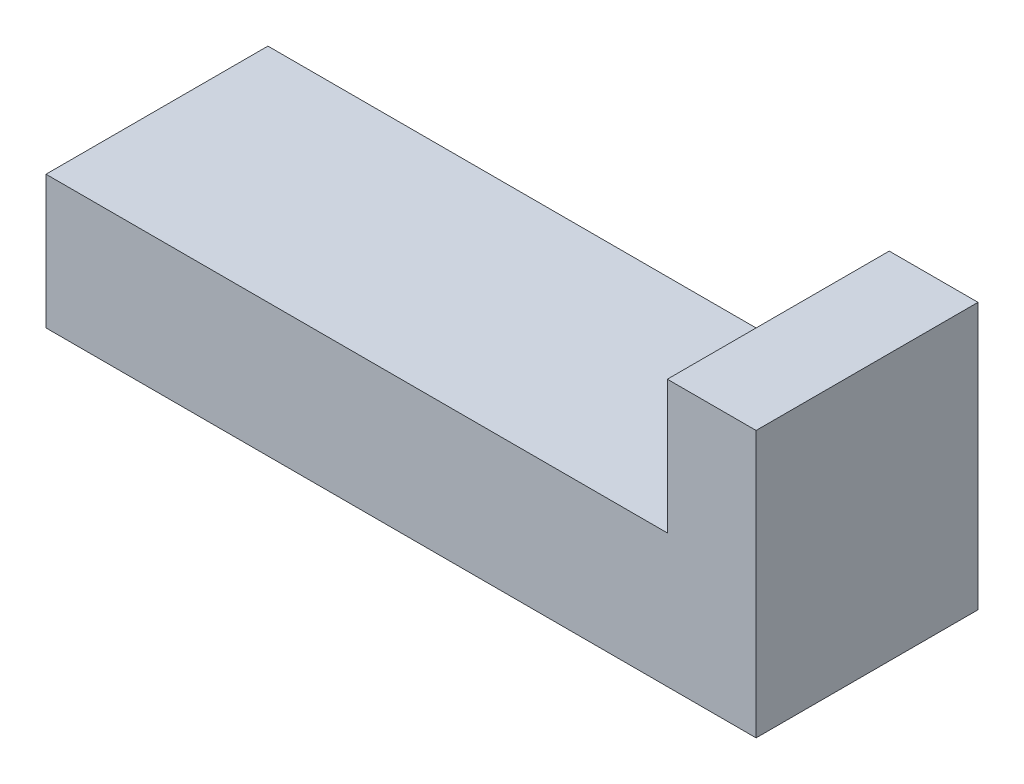
ISO-10303-21;
HEADER;
FILE_DESCRIPTION(('STEP AP214'),'2;1');
FILE_NAME('part.step','',(''),(''),'','','');
FILE_SCHEMA(('AUTOMOTIVE_DESIGN { 1 0 10303 214 1 1 1 1 }'));
ENDSEC;
DATA;
#1=APPLICATION_CONTEXT('core data for automotive mechanical design processes');
#2=APPLICATION_PROTOCOL_DEFINITION('international standard','automotive_design',2000,#1);
#3=PRODUCT_CONTEXT('',#1,'mechanical');
#4=PRODUCT('Part','Part','',(#3));
#5=PRODUCT_RELATED_PRODUCT_CATEGORY('part','',(#4));
#6=PRODUCT_DEFINITION_FORMATION('','',#4);
#7=PRODUCT_DEFINITION_CONTEXT('part definition',#1,'design');
#8=PRODUCT_DEFINITION('design','',#6,#7);
#9=PRODUCT_DEFINITION_SHAPE('','',#8);
#10=(LENGTH_UNIT() NAMED_UNIT(*) SI_UNIT(.MILLI.,.METRE.));
#11=(NAMED_UNIT(*) PLANE_ANGLE_UNIT() SI_UNIT($,.RADIAN.));
#12=(NAMED_UNIT(*) SI_UNIT($,.STERADIAN.) SOLID_ANGLE_UNIT());
#13=UNCERTAINTY_MEASURE_WITH_UNIT(LENGTH_MEASURE(1.E-05),#10,'distance_accuracy_value','');
#14=(GEOMETRIC_REPRESENTATION_CONTEXT(3) GLOBAL_UNCERTAINTY_ASSIGNED_CONTEXT((#13)) GLOBAL_UNIT_ASSIGNED_CONTEXT((#10,
#11,#12)) REPRESENTATION_CONTEXT('',''));
#15=CARTESIAN_POINT('',(0.,0.,0.));
#16=DIRECTION('',(0.,0.,1.));
#17=DIRECTION('',(1.,0.,0.));
#18=AXIS2_PLACEMENT_3D('',#15,#16,#17);
#19=CARTESIAN_POINT('',(0.,3.,5.));
#20=DIRECTION('',(1.,0.,0.));
#21=DIRECTION('',(0.,0.,-1.));
#22=AXIS2_PLACEMENT_3D('',#19,#20,#21);
#23=PLANE('',#22);
#24=DIRECTION('',(0.,-1.,0.));
#25=VECTOR('',#24,1.);
#26=CARTESIAN_POINT('',(0.,3.,0.));
#27=LINE('',#26,#25);
#28=CARTESIAN_POINT('',(0.,3.,0.));
#29=VERTEX_POINT('',#28);
#30=CARTESIAN_POINT('',(0.,0.,0.));
#31=VERTEX_POINT('',#30);
#32=EDGE_CURVE('E117',#29,#31,#27,.T.);
#33=ORIENTED_EDGE('',*,*,#32,.T.);
#34=DIRECTION('',(0.,0.,-1.));
#35=VECTOR('',#34,1.);
#36=CARTESIAN_POINT('',(0.,0.,5.));
#37=LINE('',#36,#35);
#38=CARTESIAN_POINT('',(0.,0.,5.));
#39=VERTEX_POINT('',#38);
#40=EDGE_CURVE('E11',#39,#31,#37,.T.);
#41=ORIENTED_EDGE('',*,*,#40,.F.);
#42=DIRECTION('',(0.,-1.,0.));
#43=VECTOR('',#42,1.);
#44=CARTESIAN_POINT('',(0.,3.,5.));
#45=LINE('',#44,#43);
#46=CARTESIAN_POINT('',(0.,3.,5.));
#47=VERTEX_POINT('',#46);
#48=EDGE_CURVE('E127',#47,#39,#45,.T.);
#49=ORIENTED_EDGE('',*,*,#48,.F.);
#50=DIRECTION('',(0.,0.,-1.));
#51=VECTOR('',#50,1.);
#52=CARTESIAN_POINT('',(0.,3.,5.));
#53=LINE('',#52,#51);
#54=EDGE_CURVE('E113',#47,#29,#53,.T.);
#55=ORIENTED_EDGE('',*,*,#54,.T.);
#56=EDGE_LOOP('',(#33,#41,#49,#55));
#57=FACE_BOUND('',#56,.T.);
#58=ADVANCED_FACE('F33',(#57),#23,.F.);
#59=CARTESIAN_POINT('',(0.,0.,5.));
#60=DIRECTION('',(0.,1.,0.));
#61=DIRECTION('',(0.,0.,1.));
#62=AXIS2_PLACEMENT_3D('',#59,#60,#61);
#63=PLANE('',#62);
#64=DIRECTION('',(1.,0.,0.));
#65=VECTOR('',#64,1.);
#66=CARTESIAN_POINT('',(0.,0.,0.));
#67=LINE('',#66,#65);
#68=CARTESIAN_POINT('',(16.,0.,0.));
#69=VERTEX_POINT('',#68);
#70=EDGE_CURVE('E120',#31,#69,#67,.T.);
#71=ORIENTED_EDGE('',*,*,#70,.T.);
#72=DIRECTION('',(0.,0.,-1.));
#73=VECTOR('',#72,1.);
#74=CARTESIAN_POINT('',(16.,0.,5.));
#75=LINE('',#74,#73);
#76=CARTESIAN_POINT('',(16.,0.,5.));
#77=VERTEX_POINT('',#76);
#78=EDGE_CURVE('E41',#77,#69,#75,.T.);
#79=ORIENTED_EDGE('',*,*,#78,.F.);
#80=DIRECTION('',(1.,0.,0.));
#81=VECTOR('',#80,1.);
#82=CARTESIAN_POINT('',(0.,0.,5.));
#83=LINE('',#82,#81);
#84=EDGE_CURVE('E86',#39,#77,#83,.T.);
#85=ORIENTED_EDGE('',*,*,#84,.F.);
#86=ORIENTED_EDGE('',*,*,#40,.T.);
#87=EDGE_LOOP('',(#71,#79,#85,#86));
#88=FACE_BOUND('',#87,.T.);
#89=ADVANCED_FACE('F151',(#88),#63,.F.);
#90=CARTESIAN_POINT('',(16.,0.,5.));
#91=DIRECTION('',(-1.,0.,0.));
#92=DIRECTION('',(0.,0.,1.));
#93=AXIS2_PLACEMENT_3D('',#90,#91,#92);
#94=PLANE('',#93);
#95=DIRECTION('',(0.,1.,0.));
#96=VECTOR('',#95,1.);
#97=CARTESIAN_POINT('',(16.,0.,0.));
#98=LINE('',#97,#96);
#99=CARTESIAN_POINT('',(16.,6.,0.));
#100=VERTEX_POINT('',#99);
#101=EDGE_CURVE('E122',#69,#100,#98,.T.);
#102=ORIENTED_EDGE('',*,*,#101,.T.);
#103=DIRECTION('',(0.,0.,-1.));
#104=VECTOR('',#103,1.);
#105=CARTESIAN_POINT('',(16.,6.,5.));
#106=LINE('',#105,#104);
#107=CARTESIAN_POINT('',(16.,6.,5.));
#108=VERTEX_POINT('',#107);
#109=EDGE_CURVE('E108',#108,#100,#106,.T.);
#110=ORIENTED_EDGE('',*,*,#109,.F.);
#111=DIRECTION('',(0.,1.,0.));
#112=VECTOR('',#111,1.);
#113=CARTESIAN_POINT('',(16.,0.,5.));
#114=LINE('',#113,#112);
#115=EDGE_CURVE('E99',#77,#108,#114,.T.);
#116=ORIENTED_EDGE('',*,*,#115,.F.);
#117=ORIENTED_EDGE('',*,*,#78,.T.);
#118=EDGE_LOOP('',(#102,#110,#116,#117));
#119=FACE_BOUND('',#118,.T.);
#120=ADVANCED_FACE('F133',(#119),#94,.F.);
#121=CARTESIAN_POINT('',(16.,6.,5.));
#122=DIRECTION('',(0.,-1.,0.));
#123=DIRECTION('',(0.,0.,-1.));
#124=AXIS2_PLACEMENT_3D('',#121,#122,#123);
#125=PLANE('',#124);
#126=DIRECTION('',(-1.,0.,0.));
#127=VECTOR('',#126,1.);
#128=CARTESIAN_POINT('',(16.,6.,0.));
#129=LINE('',#128,#127);
#130=CARTESIAN_POINT('',(14.,6.,0.));
#131=VERTEX_POINT('',#130);
#132=EDGE_CURVE('E107',#100,#131,#129,.T.);
#133=ORIENTED_EDGE('',*,*,#132,.T.);
#134=DIRECTION('',(0.,0.,-1.));
#135=VECTOR('',#134,1.);
#136=CARTESIAN_POINT('',(14.,6.,5.));
#137=LINE('',#136,#135);
#138=CARTESIAN_POINT('',(14.,6.,5.));
#139=VERTEX_POINT('',#138);
#140=EDGE_CURVE('E104',#139,#131,#137,.T.);
#141=ORIENTED_EDGE('',*,*,#140,.F.);
#142=DIRECTION('',(-1.,0.,0.));
#143=VECTOR('',#142,1.);
#144=CARTESIAN_POINT('',(16.,6.,5.));
#145=LINE('',#144,#143);
#146=EDGE_CURVE('E93',#108,#139,#145,.T.);
#147=ORIENTED_EDGE('',*,*,#146,.F.);
#148=ORIENTED_EDGE('',*,*,#109,.T.);
#149=EDGE_LOOP('',(#133,#141,#147,#148));
#150=FACE_BOUND('',#149,.T.);
#151=ADVANCED_FACE('F105',(#150),#125,.F.);
#152=CARTESIAN_POINT('',(14.,6.,5.));
#153=DIRECTION('',(1.,0.,0.));
#154=DIRECTION('',(0.,1.,0.));
#155=AXIS2_PLACEMENT_3D('',#152,#153,#154);
#156=PLANE('',#155);
#157=DIRECTION('',(0.,-1.,0.));
#158=VECTOR('',#157,1.);
#159=CARTESIAN_POINT('',(14.,6.,0.));
#160=LINE('',#159,#158);
#161=CARTESIAN_POINT('',(14.,3.,0.));
#162=VERTEX_POINT('',#161);
#163=EDGE_CURVE('E72',#131,#162,#160,.T.);
#164=ORIENTED_EDGE('',*,*,#163,.T.);
#165=DIRECTION('',(0.,0.,-1.));
#166=VECTOR('',#165,1.);
#167=CARTESIAN_POINT('',(14.,3.,5.));
#168=LINE('',#167,#166);
#169=CARTESIAN_POINT('',(14.,3.,5.));
#170=VERTEX_POINT('',#169);
#171=EDGE_CURVE('E109',#170,#162,#168,.T.);
#172=ORIENTED_EDGE('',*,*,#171,.F.);
#173=DIRECTION('',(0.,-1.,0.));
#174=VECTOR('',#173,1.);
#175=CARTESIAN_POINT('',(14.,6.,5.));
#176=LINE('',#175,#174);
#177=EDGE_CURVE('E97',#139,#170,#176,.T.);
#178=ORIENTED_EDGE('',*,*,#177,.F.);
#179=ORIENTED_EDGE('',*,*,#140,.T.);
#180=EDGE_LOOP('',(#164,#172,#178,#179));
#181=FACE_BOUND('',#180,.T.);
#182=ADVANCED_FACE('F111',(#181),#156,.F.);
#183=CARTESIAN_POINT('',(14.,3.,5.));
#184=DIRECTION('',(0.,-1.,0.));
#185=DIRECTION('',(1.,0.,0.));
#186=AXIS2_PLACEMENT_3D('',#183,#184,#185);
#187=PLANE('',#186);
#188=DIRECTION('',(-1.,0.,0.));
#189=VECTOR('',#188,1.);
#190=CARTESIAN_POINT('',(14.,3.,0.));
#191=LINE('',#190,#189);
#192=EDGE_CURVE('E78',#162,#29,#191,.T.);
#193=ORIENTED_EDGE('',*,*,#192,.T.);
#194=ORIENTED_EDGE('',*,*,#54,.F.);
#195=DIRECTION('',(-1.,0.,0.));
#196=VECTOR('',#195,1.);
#197=CARTESIAN_POINT('',(14.,3.,5.));
#198=LINE('',#197,#196);
#199=EDGE_CURVE('E49',#170,#47,#198,.T.);
#200=ORIENTED_EDGE('',*,*,#199,.F.);
#201=ORIENTED_EDGE('',*,*,#171,.T.);
#202=EDGE_LOOP('',(#193,#194,#200,#201));
#203=FACE_BOUND('',#202,.T.);
#204=ADVANCED_FACE('F140',(#203),#187,.F.);
#205=CARTESIAN_POINT('',(0.,0.,5.));
#206=DIRECTION('',(0.,0.,1.));
#207=DIRECTION('',(1.,0.,0.));
#208=AXIS2_PLACEMENT_3D('',#205,#206,#207);
#209=PLANE('',#208);
#210=ORIENTED_EDGE('',*,*,#48,.T.);
#211=ORIENTED_EDGE('',*,*,#84,.T.);
#212=ORIENTED_EDGE('',*,*,#115,.T.);
#213=ORIENTED_EDGE('',*,*,#146,.T.);
#214=ORIENTED_EDGE('',*,*,#177,.T.);
#215=ORIENTED_EDGE('',*,*,#199,.T.);
#216=EDGE_LOOP('',(#210,#211,#212,#213,#214,#215));
#217=FACE_BOUND('',#216,.T.);
#218=ADVANCED_FACE('F95',(#217),#209,.T.);
#219=CARTESIAN_POINT('',(0.,0.,0.));
#220=DIRECTION('',(0.,0.,1.));
#221=DIRECTION('',(1.,0.,0.));
#222=AXIS2_PLACEMENT_3D('',#219,#220,#221);
#223=PLANE('',#222);
#224=ORIENTED_EDGE('',*,*,#32,.F.);
#225=ORIENTED_EDGE('',*,*,#192,.F.);
#226=ORIENTED_EDGE('',*,*,#163,.F.);
#227=ORIENTED_EDGE('',*,*,#132,.F.);
#228=ORIENTED_EDGE('',*,*,#101,.F.);
#229=ORIENTED_EDGE('',*,*,#70,.F.);
#230=EDGE_LOOP('',(#224,#225,#226,#227,#228,#229));
#231=FACE_BOUND('',#230,.T.);
#232=ADVANCED_FACE('F136',(#231),#223,.F.);
#233=CLOSED_SHELL('',(#58,#89,#120,#151,#182,#204,#218,#232));
#234=MANIFOLD_SOLID_BREP('B2',#233);
#235=ADVANCED_BREP_SHAPE_REPRESENTATION('',(#18,#234),#14);
#236=SHAPE_DEFINITION_REPRESENTATION(#9,#235);
ENDSEC;
END-ISO-10303-21;
